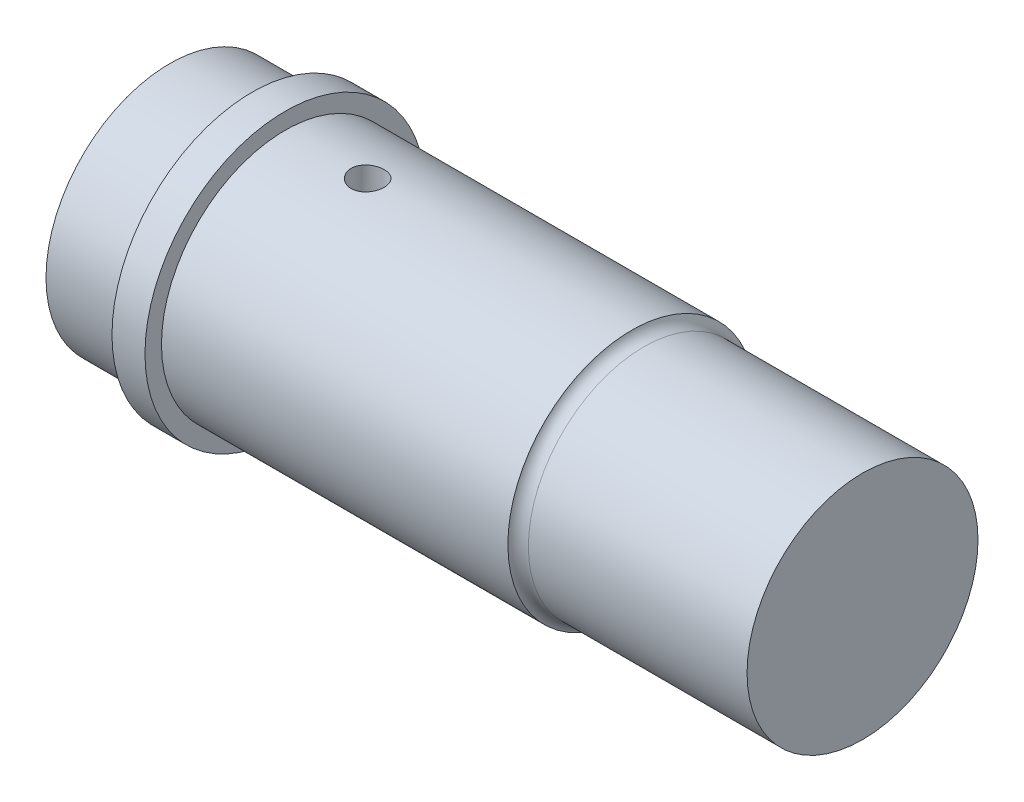
ISO-10303-21;
HEADER;
FILE_DESCRIPTION(('STEP AP214'),'2;1');
FILE_NAME('part.step','',(''),(''),'','','');
FILE_SCHEMA(('AUTOMOTIVE_DESIGN { 1 0 10303 214 1 1 1 1 }'));
ENDSEC;
DATA;
#1=APPLICATION_CONTEXT('core data for automotive mechanical design processes');
#2=APPLICATION_PROTOCOL_DEFINITION('international standard','automotive_design',2000,#1);
#3=PRODUCT_CONTEXT('',#1,'mechanical');
#4=PRODUCT('Part','Part','',(#3));
#5=PRODUCT_RELATED_PRODUCT_CATEGORY('part','',(#4));
#6=PRODUCT_DEFINITION_FORMATION('','',#4);
#7=PRODUCT_DEFINITION_CONTEXT('part definition',#1,'design');
#8=PRODUCT_DEFINITION('design','',#6,#7);
#9=PRODUCT_DEFINITION_SHAPE('','',#8);
#10=(LENGTH_UNIT() NAMED_UNIT(*) SI_UNIT(.MILLI.,.METRE.));
#11=(NAMED_UNIT(*) PLANE_ANGLE_UNIT() SI_UNIT($,.RADIAN.));
#12=(NAMED_UNIT(*) SI_UNIT($,.STERADIAN.) SOLID_ANGLE_UNIT());
#13=UNCERTAINTY_MEASURE_WITH_UNIT(LENGTH_MEASURE(1.E-05),#10,'distance_accuracy_value','');
#14=(GEOMETRIC_REPRESENTATION_CONTEXT(3) GLOBAL_UNCERTAINTY_ASSIGNED_CONTEXT((#13)) GLOBAL_UNIT_ASSIGNED_CONTEXT((#10,
#11,#12)) REPRESENTATION_CONTEXT('',''));
#15=CARTESIAN_POINT('',(0.,0.,0.));
#16=DIRECTION('',(0.,0.,1.));
#17=DIRECTION('',(1.,0.,0.));
#18=AXIS2_PLACEMENT_3D('',#15,#16,#17);
#19=CARTESIAN_POINT('',(42.,0.,0.));
#20=DIRECTION('',(-1.,0.,0.));
#21=DIRECTION('',(0.,0.,1.));
#22=AXIS2_PLACEMENT_3D('',#19,#20,#21);
#23=CYLINDRICAL_SURFACE('',#22,7.5);
#24=DIRECTION('',(-1.,0.,0.));
#25=VECTOR('',#24,1.);
#26=CARTESIAN_POINT('',(42.,-7.07106781186548,-2.5));
#27=LINE('',#26,#25);
#28=CARTESIAN_POINT('',(7.,-7.07106781186548,-2.5));
#29=VERTEX_POINT('',#28);
#30=CARTESIAN_POINT('',(26.,-7.07106781186548,-2.5));
#31=VERTEX_POINT('',#30);
#32=EDGE_CURVE('E48',#29,#31,#27,.F.);
#33=ORIENTED_EDGE('',*,*,#32,.F.);
#34=CARTESIAN_POINT('',(7.,0.,0.));
#35=DIRECTION('',(1.,0.,0.));
#36=DIRECTION('',(0.,0.,-1.));
#37=AXIS2_PLACEMENT_3D('',#34,#35,#36);
#38=CIRCLE('',#37,7.5);
#39=CARTESIAN_POINT('',(7.,-7.07106781186547,2.5));
#40=VERTEX_POINT('',#39);
#41=EDGE_CURVE('E229',#29,#40,#38,.T.);
#42=ORIENTED_EDGE('',*,*,#41,.T.);
#43=DIRECTION('',(-1.,0.,0.));
#44=VECTOR('',#43,1.);
#45=CARTESIAN_POINT('',(42.,-7.07106781186548,2.5));
#46=LINE('',#45,#44);
#47=CARTESIAN_POINT('',(26.,-7.07106781186548,2.5));
#48=VERTEX_POINT('',#47);
#49=EDGE_CURVE('E239',#48,#40,#46,.T.);
#50=ORIENTED_EDGE('',*,*,#49,.F.);
#51=CARTESIAN_POINT('',(26.,0.,0.));
#52=DIRECTION('',(1.,0.,0.));
#53=DIRECTION('',(0.,0.,-1.));
#54=AXIS2_PLACEMENT_3D('',#51,#52,#53);
#55=CIRCLE('',#54,7.5);
#56=EDGE_CURVE('E236',#48,#31,#55,.T.);
#57=ORIENTED_EDGE('',*,*,#56,.T.);
#58=EDGE_LOOP('',(#33,#42,#50,#57));
#59=FACE_BOUND('',#58,.T.);
#60=CARTESIAN_POINT('',(12.,7.43303437365925,1.));
#61=CARTESIAN_POINT('',(12.0559019277301,7.43303522266631,0.99999764297421));
#62=CARTESIAN_POINT('',(12.1118380165464,7.43367182371829,0.995296633522847));
#63=CARTESIAN_POINT('',(12.222151231157,7.43614824351763,0.976618981332773));
#64=CARTESIAN_POINT('',(12.2765267024564,7.43798929330704,0.962632848245785));
#65=CARTESIAN_POINT('',(12.382105684117,7.44266246058434,0.925806555700512));
#66=CARTESIAN_POINT('',(12.4333114058099,7.4454938777722,0.902972651375005));
#67=CARTESIAN_POINT('',(12.5311555378537,7.45182791129731,0.849112824403647));
#68=CARTESIAN_POINT('',(12.5777946794687,7.45533041990363,0.818088216317403));
#69=CARTESIAN_POINT('',(12.6654867273345,7.46263688659337,0.74851685244753));
#70=CARTESIAN_POINT('',(12.7065064328398,7.4664424424659,0.709928411374281));
#71=CARTESIAN_POINT('',(12.7815081227281,7.47391188129393,0.626414614363067));
#72=CARTESIAN_POINT('',(12.8154897457381,7.47757575696696,0.581488933235995));
#73=CARTESIAN_POINT('',(12.8755709208582,7.48436549880109,0.486365862463802));
#74=CARTESIAN_POINT('',(12.9016402446451,7.48748928251119,0.43614921885561));
#75=CARTESIAN_POINT('',(12.9449630820904,7.49282926707925,0.332001908018684));
#76=CARTESIAN_POINT('',(12.9622169661888,7.49504550607303,0.2780713969612));
#77=CARTESIAN_POINT('',(12.9873194547901,7.49830943097799,0.168367687507043));
#78=CARTESIAN_POINT('',(12.995223407506,7.49936399102537,0.112607361734948));
#79=CARTESIAN_POINT('',(13.0015733043684,7.5002092398576,0.000542501151827599));
#80=CARTESIAN_POINT('',(13.0000196688683,7.49999998481415,-0.0557620093612336));
#81=CARTESIAN_POINT('',(12.9875426347295,7.49834672058453,-0.166940062232885));
#82=CARTESIAN_POINT('',(12.9766787676272,7.49691055668904,-0.221820418680892));
#83=CARTESIAN_POINT('',(12.9459828364892,7.49297362046144,-0.328972061356277));
#84=CARTESIAN_POINT('',(12.9261505824159,7.49047282557017,-0.38124329227092));
#85=CARTESIAN_POINT('',(12.8780182794391,7.48467409502082,-0.481875904212065));
#86=CARTESIAN_POINT('',(12.8496926884085,7.48137376072939,-0.53022492467663));
#87=CARTESIAN_POINT('',(12.7853963713586,7.4743447520952,-0.621505845367393));
#88=CARTESIAN_POINT('',(12.7494252466861,7.47061605542144,-0.664437462933408));
#89=CARTESIAN_POINT('',(12.6705260758205,7.46311294047831,-0.744015030772694));
#90=CARTESIAN_POINT('',(12.6275461159032,7.459338392122,-0.780609516765106));
#91=CARTESIAN_POINT('',(12.5360270343137,7.45219749384619,-0.846073465285956));
#92=CARTESIAN_POINT('',(12.4874878905985,7.44883114554537,-0.874942897181765));
#93=CARTESIAN_POINT('',(12.3861799998266,7.4428878816717,-0.9241414304325));
#94=CARTESIAN_POINT('',(12.3334090477408,7.44031138107393,-0.944466044533533));
#95=CARTESIAN_POINT('',(12.2251609896808,7.43624737732859,-0.97595045022462));
#96=CARTESIAN_POINT('',(12.1696840329867,7.43475981418081,-0.987110746770717));
#97=CARTESIAN_POINT('',(12.0580543324975,7.43305322505173,-0.999880803843635));
#98=CARTESIAN_POINT('',(12.0019100348337,7.43282455755814,-1.00156315549406));
#99=CARTESIAN_POINT('',(11.8901403719476,7.43363612148349,-0.995521440943979));
#100=CARTESIAN_POINT('',(11.8345149941303,7.43467632202375,-0.987797603648882));
#101=CARTESIAN_POINT('',(11.7255820067972,7.43789960218385,-0.963224025185097));
#102=CARTESIAN_POINT('',(11.6722662534909,7.44007823893825,-0.946409751616798));
#103=CARTESIAN_POINT('',(11.5692105432738,7.44532929507204,-0.904169225400625));
#104=CARTESIAN_POINT('',(11.5194707283381,7.44840174991421,-0.878742631046914));
#105=CARTESIAN_POINT('',(11.4246513447796,7.45511723309759,-0.819822032086053));
#106=CARTESIAN_POINT('',(11.3796014758159,7.45876356894567,-0.7862806158315));
#107=CARTESIAN_POINT('',(11.2957445307815,7.46620571758255,-0.712149161563993));
#108=CARTESIAN_POINT('',(11.256937731926,7.47000153699967,-0.671558810718769));
#109=CARTESIAN_POINT('',(11.1864117230394,7.47734474327666,-0.584163774179119));
#110=CARTESIAN_POINT('',(11.1547403418142,7.48089035024858,-0.537320320466262));
#111=CARTESIAN_POINT('',(11.0997158589123,7.48730670739152,-0.43893622615881));
#112=CARTESIAN_POINT('',(11.0763625701219,7.49017747274246,-0.38739569125685));
#113=CARTESIAN_POINT('',(11.0387153692059,7.49491282345577,-0.281236386261717));
#114=CARTESIAN_POINT('',(11.0243942854582,7.49678042410392,-0.226627392123681));
#115=CARTESIAN_POINT('',(11.0051297572695,7.49931158343309,-0.115753246711599));
#116=CARTESIAN_POINT('',(11.0001858286461,7.49997520428063,-0.0594881810999117));
#117=CARTESIAN_POINT('',(10.9998258663798,7.50002323624209,0.0526349368557948));
#118=CARTESIAN_POINT('',(11.0043362647028,7.49941752456714,0.108492762960941));
#119=CARTESIAN_POINT('',(11.022600520616,7.4970146660993,0.218648721526177));
#120=CARTESIAN_POINT('',(11.0363543652607,7.49521752097504,0.272946856170524));
#121=CARTESIAN_POINT('',(11.0726910235383,7.49063278321235,0.37842911729443));
#122=CARTESIAN_POINT('',(11.095269813204,7.48784564204157,0.429614650771956));
#123=CARTESIAN_POINT('',(11.1486077748229,7.48158874697992,0.527482039315438));
#124=CARTESIAN_POINT('',(11.1793670978262,7.47811898048495,0.574163811199582));
#125=CARTESIAN_POINT('',(11.2484633410018,7.47085145604927,0.662073643033369));
#126=CARTESIAN_POINT('',(11.2868548950696,7.46705145149955,0.703258578582));
#127=CARTESIAN_POINT('',(11.3700115345237,7.45956932448384,0.778629477936081));
#128=CARTESIAN_POINT('',(11.4147781219606,7.45588723005032,0.812813787651156));
#129=CARTESIAN_POINT('',(11.5096419707854,7.4490405494253,0.873343954892478));
#130=CARTESIAN_POINT('',(11.559761795755,7.44587830880396,0.89965470214564));
#131=CARTESIAN_POINT('',(11.6637242337586,7.4404568329187,0.943447591407442));
#132=CARTESIAN_POINT('',(11.7175627848798,7.43819663011144,0.960939198331794));
#133=CARTESIAN_POINT('',(11.8097241393627,7.43537566912471,0.982477401892938));
#134=CARTESIAN_POINT('',(11.8474691364837,7.4345021431111,0.989038740679089));
#135=CARTESIAN_POINT('',(11.9234707547356,7.43333120737231,0.997800826715829));
#136=CARTESIAN_POINT('',(11.9617273711999,7.43303379239608,1.00000161371131));
#137=CARTESIAN_POINT('',(12.,7.43303437365925,1.));
#138=B_SPLINE_CURVE_WITH_KNOTS('',3,(#60,#61,#62,#63,#64,#65,#66,#67,#68,#69,#70,#71,#72,#73,
#74,#75,#76,#77,#78,#79,#80,#81,#82,#83,#84,#85,#86,#87,#88,#89,#90,#91,#92,#93,#94,#95,#96,#97,
#98,#99,#100,#101,#102,#103,#104,#105,#106,#107,#108,#109,#110,#111,#112,#113,#114,#115,#116,
#117,#118,#119,#120,#121,#122,#123,#124,#125,#126,#127,#128,#129,#130,#131,#132,#133,#134,#135,
#136,#137),.UNSPECIFIED.,.T.,.F.,(4,2,2,2,2,2,2,2,2,2,2,2,2,2,2,2,2,2,2,2,2,2,2,2,2,2,2,2,2,2,2,
2,2,2,2,2,2,2,4),(0.,0.16756594461955,0.335303423041822,0.502922531373104,0.67051475416376,
0.839057975594805,1.00760984880017,1.17679778261471,1.34597860627362,1.51415284761382,
1.68231961431326,1.84941904333874,2.01652201332237,2.18413264227024,2.35175201291212,
2.52067457533377,2.68959780758443,2.85860963826768,3.02761215573449,3.19531851289863,
3.36302078890669,3.53007342408195,3.69713268808003,3.86519264070064,4.03326005374208,
4.2024225588115,4.37158125836474,4.54022861884065,4.70886727109971,4.87619854927048,
5.04352959309218,5.21078442673995,5.37804234889437,5.54654371183369,5.71508484203598,
5.88436670989948,6.05346651155517,6.16818970471025,6.28291185219902),.UNSPECIFIED.);
#139=CARTESIAN_POINT('',(12.,7.43303437365925,1.));
#140=VERTEX_POINT('',#139);
#141=EDGE_CURVE('E152',#140,#140,#138,.T.);
#142=ORIENTED_EDGE('',*,*,#141,.F.);
#143=EDGE_LOOP('',(#142));
#144=FACE_BOUND('',#143,.T.);
#145=CARTESIAN_POINT('',(28.,0.,0.));
#146=DIRECTION('',(1.,0.,0.));
#147=DIRECTION('',(0.,0.,-1.));
#148=AXIS2_PLACEMENT_3D('',#145,#146,#147);
#149=CIRCLE('',#148,7.5);
#150=CARTESIAN_POINT('',(28.,0.,-7.5));
#151=VERTEX_POINT('',#150);
#152=EDGE_CURVE('E142',#151,#151,#149,.T.);
#153=ORIENTED_EDGE('',*,*,#152,.F.);
#154=EDGE_LOOP('',(#153));
#155=FACE_BOUND('',#154,.T.);
#156=ADVANCED_FACE('F39',(#59,#144,#155),#23,.T.);
#157=CARTESIAN_POINT('',(5.,0.,0.));
#158=DIRECTION('',(-1.,0.,0.));
#159=DIRECTION('',(0.,0.,1.));
#160=AXIS2_PLACEMENT_3D('',#157,#158,#159);
#161=CYLINDRICAL_SURFACE('',#160,7.5);
#162=CARTESIAN_POINT('',(5.,0.,0.));
#163=DIRECTION('',(1.,0.,0.));
#164=DIRECTION('',(0.,0.,-1.));
#165=AXIS2_PLACEMENT_3D('',#162,#163,#164);
#166=CIRCLE('',#165,7.5);
#167=CARTESIAN_POINT('',(5.,0.,-7.5));
#168=VERTEX_POINT('',#167);
#169=EDGE_CURVE('E219',#168,#168,#166,.T.);
#170=ORIENTED_EDGE('',*,*,#169,.F.);
#171=EDGE_LOOP('',(#170));
#172=FACE_BOUND('',#171,.T.);
#173=CARTESIAN_POINT('',(0.,0.,0.));
#174=DIRECTION('',(1.,0.,0.));
#175=DIRECTION('',(0.,0.,-1.));
#176=AXIS2_PLACEMENT_3D('',#173,#174,#175);
#177=CIRCLE('',#176,7.5);
#178=CARTESIAN_POINT('',(0.,0.,-7.5));
#179=VERTEX_POINT('',#178);
#180=EDGE_CURVE('E222',#179,#179,#177,.T.);
#181=ORIENTED_EDGE('',*,*,#180,.T.);
#182=EDGE_LOOP('',(#181));
#183=FACE_BOUND('',#182,.T.);
#184=ADVANCED_FACE('F196',(#172,#183),#161,.T.);
#185=CARTESIAN_POINT('',(0.,0.,0.));
#186=DIRECTION('',(1.,0.,0.));
#187=DIRECTION('',(0.,0.,-1.));
#188=AXIS2_PLACEMENT_3D('',#185,#186,#187);
#189=PLANE('',#188);
#190=DIRECTION('',(0.,0.,-1.));
#191=VECTOR('',#190,1.);
#192=CARTESIAN_POINT('',(0.,4.75,-1.5));
#193=LINE('',#192,#191);
#194=CARTESIAN_POINT('',(0.,4.75,1.5));
#195=VERTEX_POINT('',#194);
#196=CARTESIAN_POINT('',(0.,4.75,-1.5));
#197=VERTEX_POINT('',#196);
#198=EDGE_CURVE('E277',#195,#197,#193,.T.);
#199=ORIENTED_EDGE('',*,*,#198,.F.);
#200=DIRECTION('',(0.,1.,0.));
#201=VECTOR('',#200,1.);
#202=CARTESIAN_POINT('',(0.,3.25,1.5));
#203=LINE('',#202,#201);
#204=CARTESIAN_POINT('',(0.,3.70809924354783,1.5));
#205=VERTEX_POINT('',#204);
#206=EDGE_CURVE('E161',#205,#195,#203,.T.);
#207=ORIENTED_EDGE('',*,*,#206,.F.);
#208=CARTESIAN_POINT('',(0.,0.,0.));
#209=DIRECTION('',(-1.,0.,0.));
#210=DIRECTION('',(0.,0.,1.));
#211=AXIS2_PLACEMENT_3D('',#208,#209,#210);
#212=CIRCLE('',#211,4.);
#213=CARTESIAN_POINT('',(0.,3.70809924354783,-1.5));
#214=VERTEX_POINT('',#213);
#215=EDGE_CURVE('E247',#214,#205,#212,.T.);
#216=ORIENTED_EDGE('',*,*,#215,.F.);
#217=DIRECTION('',(0.,-1.,0.));
#218=VECTOR('',#217,1.);
#219=CARTESIAN_POINT('',(0.,3.25,-1.5));
#220=LINE('',#219,#218);
#221=EDGE_CURVE('E274',#197,#214,#220,.T.);
#222=ORIENTED_EDGE('',*,*,#221,.F.);
#223=EDGE_LOOP('',(#199,#207,#216,#222));
#224=FACE_BOUND('',#223,.T.);
#225=ORIENTED_EDGE('',*,*,#180,.F.);
#226=EDGE_LOOP('',(#225));
#227=FACE_BOUND('',#226,.T.);
#228=ADVANCED_FACE('F208',(#224,#227),#189,.F.);
#229=CARTESIAN_POINT('',(7.,0.,0.));
#230=DIRECTION('',(-1.,0.,0.));
#231=DIRECTION('',(0.,0.,1.));
#232=AXIS2_PLACEMENT_3D('',#229,#230,#231);
#233=CYLINDRICAL_SURFACE('',#232,8.5);
#234=CARTESIAN_POINT('',(7.,0.,0.));
#235=DIRECTION('',(1.,0.,0.));
#236=DIRECTION('',(0.,0.,-1.));
#237=AXIS2_PLACEMENT_3D('',#234,#235,#236);
#238=CIRCLE('',#237,8.5);
#239=CARTESIAN_POINT('',(7.,0.,-8.5));
#240=VERTEX_POINT('',#239);
#241=EDGE_CURVE('E225',#240,#240,#238,.T.);
#242=ORIENTED_EDGE('',*,*,#241,.F.);
#243=EDGE_LOOP('',(#242));
#244=FACE_BOUND('',#243,.T.);
#245=CARTESIAN_POINT('',(5.,0.,0.));
#246=DIRECTION('',(1.,0.,0.));
#247=DIRECTION('',(0.,0.,-1.));
#248=AXIS2_PLACEMENT_3D('',#245,#246,#247);
#249=CIRCLE('',#248,8.5);
#250=CARTESIAN_POINT('',(5.,0.,-8.5));
#251=VERTEX_POINT('',#250);
#252=EDGE_CURVE('E232',#251,#251,#249,.T.);
#253=ORIENTED_EDGE('',*,*,#252,.T.);
#254=EDGE_LOOP('',(#253));
#255=FACE_BOUND('',#254,.T.);
#256=ADVANCED_FACE('F201',(#244,#255),#233,.T.);
#257=CARTESIAN_POINT('',(7.,0.,0.));
#258=DIRECTION('',(1.,0.,0.));
#259=DIRECTION('',(0.,0.,-1.));
#260=AXIS2_PLACEMENT_3D('',#257,#258,#259);
#261=PLANE('',#260);
#262=ORIENTED_EDGE('',*,*,#241,.T.);
#263=EDGE_LOOP('',(#262));
#264=FACE_BOUND('',#263,.T.);
#265=ORIENTED_EDGE('',*,*,#41,.F.);
#266=DIRECTION('',(0.,1.,0.));
#267=VECTOR('',#266,1.);
#268=CARTESIAN_POINT('',(7.,0.,-2.5));
#269=LINE('',#268,#267);
#270=CARTESIAN_POINT('',(7.,-5.5,-2.5));
#271=VERTEX_POINT('',#270);
#272=EDGE_CURVE('E139',#29,#271,#269,.T.);
#273=ORIENTED_EDGE('',*,*,#272,.T.);
#274=DIRECTION('',(0.,0.,1.));
#275=VECTOR('',#274,1.);
#276=CARTESIAN_POINT('',(7.,-5.5,0.));
#277=LINE('',#276,#275);
#278=CARTESIAN_POINT('',(7.,-5.5,2.5));
#279=VERTEX_POINT('',#278);
#280=EDGE_CURVE('E124',#271,#279,#277,.T.);
#281=ORIENTED_EDGE('',*,*,#280,.T.);
#282=DIRECTION('',(0.,-1.,0.));
#283=VECTOR('',#282,1.);
#284=CARTESIAN_POINT('',(7.,0.,2.5));
#285=LINE('',#284,#283);
#286=EDGE_CURVE('E55',#279,#40,#285,.T.);
#287=ORIENTED_EDGE('',*,*,#286,.T.);
#288=EDGE_LOOP('',(#265,#273,#281,#287));
#289=FACE_BOUND('',#288,.T.);
#290=ADVANCED_FACE('F198',(#264,#289),#261,.T.);
#291=CARTESIAN_POINT('',(5.,0.,0.));
#292=DIRECTION('',(1.,0.,0.));
#293=DIRECTION('',(0.,0.,-1.));
#294=AXIS2_PLACEMENT_3D('',#291,#292,#293);
#295=PLANE('',#294);
#296=ORIENTED_EDGE('',*,*,#169,.T.);
#297=EDGE_LOOP('',(#296));
#298=FACE_BOUND('',#297,.T.);
#299=ORIENTED_EDGE('',*,*,#252,.F.);
#300=EDGE_LOOP('',(#299));
#301=FACE_BOUND('',#300,.T.);
#302=ADVANCED_FACE('F187',(#298,#301),#295,.F.);
#303=CARTESIAN_POINT('',(20.5,0.,0.));
#304=DIRECTION('',(-1.,0.,0.));
#305=DIRECTION('',(0.,0.,1.));
#306=AXIS2_PLACEMENT_3D('',#303,#304,#305);
#307=CYLINDRICAL_SURFACE('',#306,4.);
#308=ORIENTED_EDGE('',*,*,#215,.T.);
#309=DIRECTION('',(-1.,0.,0.));
#310=VECTOR('',#309,1.);
#311=CARTESIAN_POINT('',(20.5,3.70809924354783,1.5));
#312=LINE('',#311,#310);
#313=CARTESIAN_POINT('',(20.5,3.70809924354783,1.5));
#314=VERTEX_POINT('',#313);
#315=EDGE_CURVE('E258',#205,#314,#312,.F.);
#316=ORIENTED_EDGE('',*,*,#315,.T.);
#317=CARTESIAN_POINT('',(20.5,0.,0.));
#318=DIRECTION('',(-1.,0.,0.));
#319=DIRECTION('',(0.,0.,1.));
#320=AXIS2_PLACEMENT_3D('',#317,#318,#319);
#321=CIRCLE('',#320,4.);
#322=CARTESIAN_POINT('',(20.5,3.70809924354783,-1.5));
#323=VERTEX_POINT('',#322);
#324=EDGE_CURVE('E251',#323,#314,#321,.T.);
#325=ORIENTED_EDGE('',*,*,#324,.F.);
#326=DIRECTION('',(-1.,0.,0.));
#327=VECTOR('',#326,1.);
#328=CARTESIAN_POINT('',(20.5,3.70809924354783,-1.5));
#329=LINE('',#328,#327);
#330=EDGE_CURVE('E263',#323,#214,#329,.T.);
#331=ORIENTED_EDGE('',*,*,#330,.T.);
#332=EDGE_LOOP('',(#308,#316,#325,#331));
#333=FACE_BOUND('',#332,.T.);
#334=ADVANCED_FACE('F184',(#333),#307,.F.);
#335=CARTESIAN_POINT('',(20.5,0.,0.));
#336=DIRECTION('',(-1.,0.,0.));
#337=DIRECTION('',(0.,0.,1.));
#338=AXIS2_PLACEMENT_3D('',#335,#336,#337);
#339=PLANE('',#338);
#340=ORIENTED_EDGE('',*,*,#324,.T.);
#341=DIRECTION('',(0.,1.,0.));
#342=VECTOR('',#341,1.);
#343=CARTESIAN_POINT('',(20.5,3.25,1.5));
#344=LINE('',#343,#342);
#345=CARTESIAN_POINT('',(20.5,4.75,1.5));
#346=VERTEX_POINT('',#345);
#347=EDGE_CURVE('E162',#314,#346,#344,.T.);
#348=ORIENTED_EDGE('',*,*,#347,.T.);
#349=DIRECTION('',(0.,0.,-1.));
#350=VECTOR('',#349,1.);
#351=CARTESIAN_POINT('',(20.5,4.75,-1.5));
#352=LINE('',#351,#350);
#353=CARTESIAN_POINT('',(20.5,4.75,-1.5));
#354=VERTEX_POINT('',#353);
#355=EDGE_CURVE('E284',#346,#354,#352,.T.);
#356=ORIENTED_EDGE('',*,*,#355,.T.);
#357=DIRECTION('',(0.,-1.,0.));
#358=VECTOR('',#357,1.);
#359=CARTESIAN_POINT('',(20.5,3.25,-1.5));
#360=LINE('',#359,#358);
#361=EDGE_CURVE('E63',#354,#323,#360,.T.);
#362=ORIENTED_EDGE('',*,*,#361,.T.);
#363=EDGE_LOOP('',(#340,#348,#356,#362));
#364=FACE_BOUND('',#363,.T.);
#365=ADVANCED_FACE('F180',(#364),#339,.T.);
#366=CARTESIAN_POINT('',(20.5,3.25,1.5));
#367=DIRECTION('',(0.,0.,1.));
#368=DIRECTION('',(1.,0.,0.));
#369=AXIS2_PLACEMENT_3D('',#366,#367,#368);
#370=PLANE('',#369);
#371=ORIENTED_EDGE('',*,*,#206,.T.);
#372=DIRECTION('',(-1.,0.,0.));
#373=VECTOR('',#372,1.);
#374=CARTESIAN_POINT('',(20.5,4.75,1.5));
#375=LINE('',#374,#373);
#376=EDGE_CURVE('E268',#346,#195,#375,.T.);
#377=ORIENTED_EDGE('',*,*,#376,.F.);
#378=ORIENTED_EDGE('',*,*,#347,.F.);
#379=ORIENTED_EDGE('',*,*,#315,.F.);
#380=EDGE_LOOP('',(#371,#377,#378,#379));
#381=FACE_BOUND('',#380,.T.);
#382=ADVANCED_FACE('F173',(#381),#370,.F.);
#383=CARTESIAN_POINT('',(20.5,3.25,-1.5));
#384=DIRECTION('',(0.,0.,-1.));
#385=DIRECTION('',(-1.,0.,0.));
#386=AXIS2_PLACEMENT_3D('',#383,#384,#385);
#387=PLANE('',#386);
#388=ORIENTED_EDGE('',*,*,#361,.F.);
#389=DIRECTION('',(-1.,0.,0.));
#390=VECTOR('',#389,1.);
#391=CARTESIAN_POINT('',(20.5,4.75,-1.5));
#392=LINE('',#391,#390);
#393=EDGE_CURVE('E267',#354,#197,#392,.T.);
#394=ORIENTED_EDGE('',*,*,#393,.T.);
#395=ORIENTED_EDGE('',*,*,#221,.T.);
#396=ORIENTED_EDGE('',*,*,#330,.F.);
#397=EDGE_LOOP('',(#388,#394,#395,#396));
#398=FACE_BOUND('',#397,.T.);
#399=ADVANCED_FACE('F169',(#398),#387,.F.);
#400=CARTESIAN_POINT('',(20.5,4.75,-1.5));
#401=DIRECTION('',(0.,1.,0.));
#402=DIRECTION('',(0.,0.,1.));
#403=AXIS2_PLACEMENT_3D('',#400,#401,#402);
#404=PLANE('',#403);
#405=CARTESIAN_POINT('',(12.,4.75,0.));
#406=DIRECTION('',(0.,1.,0.));
#407=DIRECTION('',(0.,0.,1.));
#408=AXIS2_PLACEMENT_3D('',#405,#406,#407);
#409=CIRCLE('',#408,1.);
#410=CARTESIAN_POINT('',(12.,4.75,1.));
#411=VERTEX_POINT('',#410);
#412=EDGE_CURVE('E126',#411,#411,#409,.F.);
#413=ORIENTED_EDGE('',*,*,#412,.F.);
#414=EDGE_LOOP('',(#413));
#415=FACE_BOUND('',#414,.T.);
#416=ORIENTED_EDGE('',*,*,#198,.T.);
#417=ORIENTED_EDGE('',*,*,#393,.F.);
#418=ORIENTED_EDGE('',*,*,#355,.F.);
#419=ORIENTED_EDGE('',*,*,#376,.T.);
#420=EDGE_LOOP('',(#416,#417,#418,#419));
#421=FACE_BOUND('',#420,.T.);
#422=ADVANCED_FACE('F172',(#415,#421),#404,.F.);
#423=CARTESIAN_POINT('',(12.,-8.501,0.));
#424=DIRECTION('',(0.,1.,0.));
#425=DIRECTION('',(0.,0.,1.));
#426=AXIS2_PLACEMENT_3D('',#423,#424,#425);
#427=CYLINDRICAL_SURFACE('',#426,1.);
#428=ORIENTED_EDGE('',*,*,#412,.T.);
#429=EDGE_LOOP('',(#428));
#430=FACE_BOUND('',#429,.T.);
#431=ORIENTED_EDGE('',*,*,#141,.T.);
#432=EDGE_LOOP('',(#431));
#433=FACE_BOUND('',#432,.T.);
#434=ADVANCED_FACE('F164',(#430,#433),#427,.F.);
#435=CARTESIAN_POINT('',(26.,0.,-2.5));
#436=DIRECTION('',(0.,0.,1.));
#437=DIRECTION('',(0.,-1.,0.));
#438=AXIS2_PLACEMENT_3D('',#435,#436,#437);
#439=PLANE('',#438);
#440=ORIENTED_EDGE('',*,*,#32,.T.);
#441=DIRECTION('',(0.,1.,0.));
#442=VECTOR('',#441,1.);
#443=CARTESIAN_POINT('',(26.,0.,-2.5));
#444=LINE('',#443,#442);
#445=CARTESIAN_POINT('',(26.,-5.5,-2.5));
#446=VERTEX_POINT('',#445);
#447=EDGE_CURVE('E108',#31,#446,#444,.T.);
#448=ORIENTED_EDGE('',*,*,#447,.T.);
#449=DIRECTION('',(-1.,0.,0.));
#450=VECTOR('',#449,1.);
#451=CARTESIAN_POINT('',(26.,-5.5,-2.5));
#452=LINE('',#451,#450);
#453=EDGE_CURVE('E111',#446,#271,#452,.T.);
#454=ORIENTED_EDGE('',*,*,#453,.T.);
#455=ORIENTED_EDGE('',*,*,#272,.F.);
#456=EDGE_LOOP('',(#440,#448,#454,#455));
#457=FACE_BOUND('',#456,.T.);
#458=ADVANCED_FACE('F110',(#457),#439,.T.);
#459=CARTESIAN_POINT('',(26.,0.,2.5));
#460=DIRECTION('',(0.,0.,-1.));
#461=DIRECTION('',(0.,1.,0.));
#462=AXIS2_PLACEMENT_3D('',#459,#460,#461);
#463=PLANE('',#462);
#464=ORIENTED_EDGE('',*,*,#49,.T.);
#465=ORIENTED_EDGE('',*,*,#286,.F.);
#466=DIRECTION('',(-1.,0.,0.));
#467=VECTOR('',#466,1.);
#468=CARTESIAN_POINT('',(26.,-5.5,2.5));
#469=LINE('',#468,#467);
#470=CARTESIAN_POINT('',(26.,-5.5,2.5));
#471=VERTEX_POINT('',#470);
#472=EDGE_CURVE('E127',#471,#279,#469,.T.);
#473=ORIENTED_EDGE('',*,*,#472,.F.);
#474=DIRECTION('',(0.,-1.,0.));
#475=VECTOR('',#474,1.);
#476=CARTESIAN_POINT('',(26.,0.,2.5));
#477=LINE('',#476,#475);
#478=EDGE_CURVE('E132',#471,#48,#477,.T.);
#479=ORIENTED_EDGE('',*,*,#478,.T.);
#480=EDGE_LOOP('',(#464,#465,#473,#479));
#481=FACE_BOUND('',#480,.T.);
#482=ADVANCED_FACE('F297',(#481),#463,.T.);
#483=CARTESIAN_POINT('',(26.,0.,0.));
#484=DIRECTION('',(1.,0.,0.));
#485=DIRECTION('',(0.,0.,-1.));
#486=AXIS2_PLACEMENT_3D('',#483,#484,#485);
#487=PLANE('',#486);
#488=ORIENTED_EDGE('',*,*,#478,.F.);
#489=DIRECTION('',(0.,0.,1.));
#490=VECTOR('',#489,1.);
#491=CARTESIAN_POINT('',(26.,-5.5,0.));
#492=LINE('',#491,#490);
#493=EDGE_CURVE('E118',#446,#471,#492,.T.);
#494=ORIENTED_EDGE('',*,*,#493,.F.);
#495=ORIENTED_EDGE('',*,*,#447,.F.);
#496=ORIENTED_EDGE('',*,*,#56,.F.);
#497=EDGE_LOOP('',(#488,#494,#495,#496));
#498=FACE_BOUND('',#497,.T.);
#499=ADVANCED_FACE('F130',(#498),#487,.F.);
#500=CARTESIAN_POINT('',(26.,-5.5,0.));
#501=DIRECTION('',(0.,-1.,0.));
#502=DIRECTION('',(0.,0.,-1.));
#503=AXIS2_PLACEMENT_3D('',#500,#501,#502);
#504=PLANE('',#503);
#505=ORIENTED_EDGE('',*,*,#280,.F.);
#506=ORIENTED_EDGE('',*,*,#453,.F.);
#507=ORIENTED_EDGE('',*,*,#493,.T.);
#508=ORIENTED_EDGE('',*,*,#472,.T.);
#509=EDGE_LOOP('',(#505,#506,#507,#508));
#510=FACE_BOUND('',#509,.T.);
#511=ADVANCED_FACE('F121',(#510),#504,.T.);
#512=CARTESIAN_POINT('',(28.,0.,0.));
#513=DIRECTION('',(1.,0.,0.));
#514=DIRECTION('',(0.,0.,-1.));
#515=AXIS2_PLACEMENT_3D('',#512,#513,#514);
#516=CYLINDRICAL_SURFACE('',#515,7.);
#517=CARTESIAN_POINT('',(28.7416198487096,0.,0.));
#518=DIRECTION('',(-1.,0.,0.));
#519=DIRECTION('',(0.,0.,1.));
#520=AXIS2_PLACEMENT_3D('',#517,#518,#519);
#521=CIRCLE('',#520,7.);
#522=CARTESIAN_POINT('',(28.7416198487096,0.,7.));
#523=VERTEX_POINT('',#522);
#524=EDGE_CURVE('E11',#523,#523,#521,.F.);
#525=ORIENTED_EDGE('',*,*,#524,.T.);
#526=EDGE_LOOP('',(#525));
#527=FACE_BOUND('',#526,.T.);
#528=CARTESIAN_POINT('',(42.,0.,0.));
#529=DIRECTION('',(1.,0.,0.));
#530=DIRECTION('',(0.,0.,-1.));
#531=AXIS2_PLACEMENT_3D('',#528,#529,#530);
#532=CIRCLE('',#531,7.);
#533=CARTESIAN_POINT('',(42.,0.,-7.));
#534=VERTEX_POINT('',#533);
#535=EDGE_CURVE('E318',#534,#534,#532,.T.);
#536=ORIENTED_EDGE('',*,*,#535,.F.);
#537=EDGE_LOOP('',(#536));
#538=FACE_BOUND('',#537,.T.);
#539=ADVANCED_FACE('F192',(#527,#538),#516,.T.);
#540=CARTESIAN_POINT('',(42.,0.,0.));
#541=DIRECTION('',(1.,0.,0.));
#542=DIRECTION('',(0.,0.,-1.));
#543=AXIS2_PLACEMENT_3D('',#540,#541,#542);
#544=PLANE('',#543);
#545=ORIENTED_EDGE('',*,*,#535,.T.);
#546=EDGE_LOOP('',(#545));
#547=FACE_BOUND('',#546,.T.);
#548=ADVANCED_FACE('F189',(#547),#544,.T.);
#549=CARTESIAN_POINT('',(28.7416198487096,0.,0.));
#550=DIRECTION('',(-1.,0.,0.));
#551=DIRECTION('',(0.,0.,1.));
#552=AXIS2_PLACEMENT_3D('',#549,#550,#551);
#553=TOROIDAL_SURFACE('',#552,7.8,0.8);
#554=ORIENTED_EDGE('',*,*,#152,.T.);
#555=EDGE_LOOP('',(#554));
#556=FACE_BOUND('',#555,.T.);
#557=ORIENTED_EDGE('',*,*,#524,.F.);
#558=EDGE_LOOP('',(#557));
#559=FACE_BOUND('',#558,.T.);
#560=ADVANCED_FACE('F41',(#556,#559),#553,.F.);
#561=CLOSED_SHELL('',(#156,#184,#228,#256,#290,#302,#334,#365,#382,#399,#422,#434,#458,#482,
#499,#511,#539,#548,#560));
#562=MANIFOLD_SOLID_BREP('B2',#561);
#563=ADVANCED_BREP_SHAPE_REPRESENTATION('',(#18,#562),#14);
#564=SHAPE_DEFINITION_REPRESENTATION(#9,#563);
ENDSEC;
END-ISO-10303-21;
